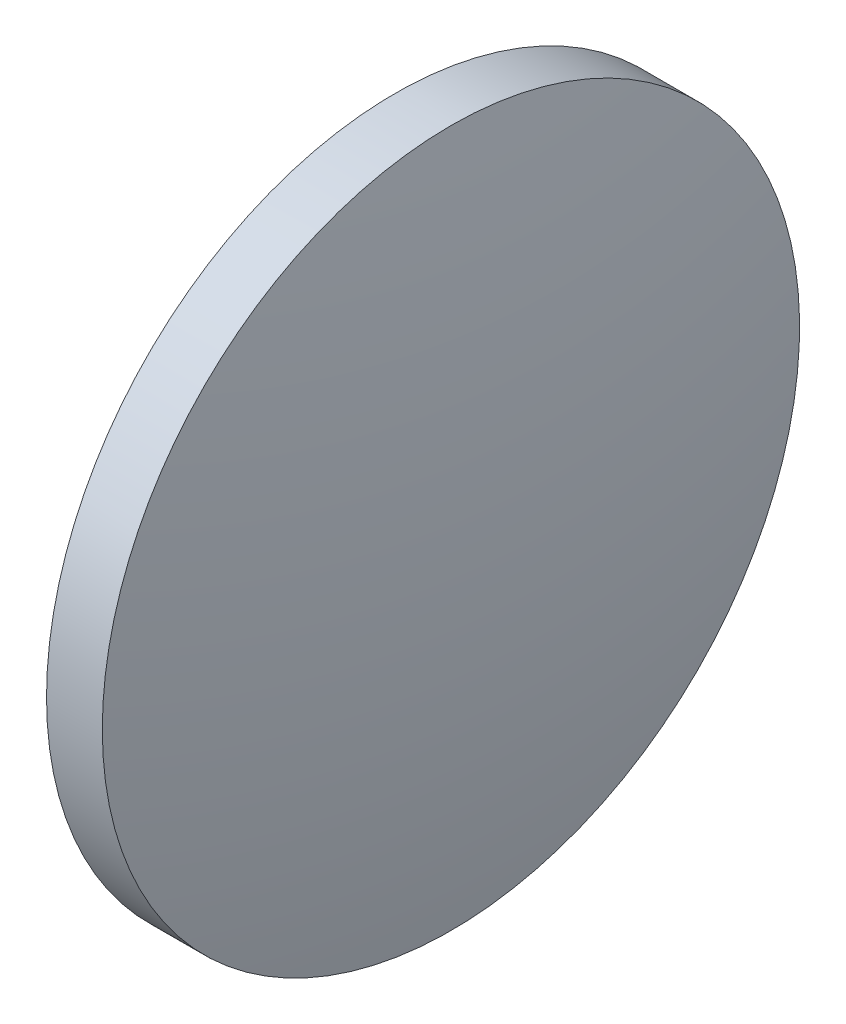
ISO-10303-21;
HEADER;
FILE_DESCRIPTION(('STEP AP214'),'2;1');
FILE_NAME('part.step','',(''),(''),'','','');
FILE_SCHEMA(('AUTOMOTIVE_DESIGN { 1 0 10303 214 1 1 1 1 }'));
ENDSEC;
DATA;
#1=APPLICATION_CONTEXT('core data for automotive mechanical design processes');
#2=APPLICATION_PROTOCOL_DEFINITION('international standard','automotive_design',2000,#1);
#3=PRODUCT_CONTEXT('',#1,'mechanical');
#4=PRODUCT('Part','Part','',(#3));
#5=PRODUCT_RELATED_PRODUCT_CATEGORY('part','',(#4));
#6=PRODUCT_DEFINITION_FORMATION('','',#4);
#7=PRODUCT_DEFINITION_CONTEXT('part definition',#1,'design');
#8=PRODUCT_DEFINITION('design','',#6,#7);
#9=PRODUCT_DEFINITION_SHAPE('','',#8);
#10=(LENGTH_UNIT() NAMED_UNIT(*) SI_UNIT(.MILLI.,.METRE.));
#11=(NAMED_UNIT(*) PLANE_ANGLE_UNIT() SI_UNIT($,.RADIAN.));
#12=(NAMED_UNIT(*) SI_UNIT($,.STERADIAN.) SOLID_ANGLE_UNIT());
#13=UNCERTAINTY_MEASURE_WITH_UNIT(LENGTH_MEASURE(1.E-05),#10,'distance_accuracy_value','');
#14=(GEOMETRIC_REPRESENTATION_CONTEXT(3) GLOBAL_UNCERTAINTY_ASSIGNED_CONTEXT((#13)) GLOBAL_UNIT_ASSIGNED_CONTEXT((#10,
#11,#12)) REPRESENTATION_CONTEXT('',''));
#15=CARTESIAN_POINT('',(0.,0.,0.));
#16=DIRECTION('',(0.,0.,1.));
#17=DIRECTION('',(1.,0.,0.));
#18=AXIS2_PLACEMENT_3D('',#15,#16,#17);
#19=CARTESIAN_POINT('',(600.267572038258,112.677785051763,0.));
#20=DIRECTION('',(-1.,0.,0.));
#21=DIRECTION('',(0.,1.,0.));
#22=AXIS2_PLACEMENT_3D('',#19,#20,#21);
#23=SPHERICAL_SURFACE('',#22,64.6468852459018);
#24=CARTESIAN_POINT('',(663.694457284159,112.677785051763,0.));
#25=DIRECTION('',(-1.,0.,0.));
#26=DIRECTION('',(0.,0.,1.));
#27=AXIS2_PLACEMENT_3D('',#24,#25,#26);
#28=CIRCLE('',#27,12.5);
#29=CARTESIAN_POINT('',(663.694457284159,112.677785051763,12.5));
#30=VERTEX_POINT('',#29);
#31=EDGE_CURVE('E10',#30,#30,#28,.T.);
#32=ORIENTED_EDGE('',*,*,#31,.F.);
#33=EDGE_LOOP('',(#32));
#34=FACE_BOUND('',#33,.T.);
#35=ADVANCED_FACE('F35',(#34),#23,.T.);
#36=CARTESIAN_POINT('',(659.328841381398,112.677785051763,0.));
#37=DIRECTION('',(-1.,0.,0.));
#38=DIRECTION('',(0.,0.,1.));
#39=AXIS2_PLACEMENT_3D('',#36,#37,#38);
#40=CYLINDRICAL_SURFACE('',#39,12.5);
#41=CARTESIAN_POINT('',(661.694457284159,112.677785051763,0.));
#42=DIRECTION('',(-1.,0.,0.));
#43=DIRECTION('',(0.,0.,1.));
#44=AXIS2_PLACEMENT_3D('',#41,#42,#43);
#45=CIRCLE('',#44,12.5);
#46=CARTESIAN_POINT('',(661.694457284159,112.677785051763,12.5));
#47=VERTEX_POINT('',#46);
#48=EDGE_CURVE('E41',#47,#47,#45,.T.);
#49=ORIENTED_EDGE('',*,*,#48,.F.);
#50=EDGE_LOOP('',(#49));
#51=FACE_BOUND('',#50,.T.);
#52=ORIENTED_EDGE('',*,*,#31,.T.);
#53=EDGE_LOOP('',(#52));
#54=FACE_BOUND('',#53,.T.);
#55=ADVANCED_FACE('F49',(#51,#54),#40,.T.);
#56=CARTESIAN_POINT('',(661.694457284159,112.677785051763,0.));
#57=DIRECTION('',(1.,0.,0.));
#58=DIRECTION('',(0.,0.,-1.));
#59=AXIS2_PLACEMENT_3D('',#56,#57,#58);
#60=PLANE('',#59);
#61=ORIENTED_EDGE('',*,*,#48,.T.);
#62=EDGE_LOOP('',(#61));
#63=FACE_BOUND('',#62,.T.);
#64=ADVANCED_FACE('F47',(#63),#60,.F.);
#65=CLOSED_SHELL('',(#35,#55,#64));
#66=MANIFOLD_SOLID_BREP('B2',#65);
#67=ADVANCED_BREP_SHAPE_REPRESENTATION('',(#18,#66),#14);
#68=SHAPE_DEFINITION_REPRESENTATION(#9,#67);
ENDSEC;
END-ISO-10303-21;
